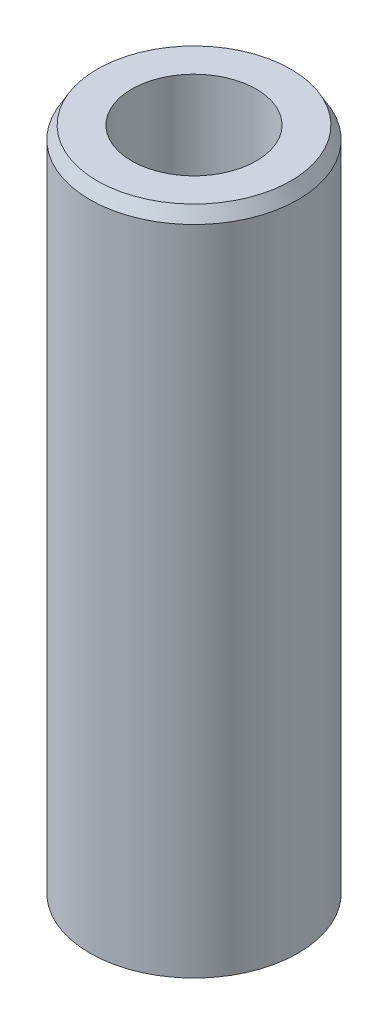
ISO-10303-21;
HEADER;
FILE_DESCRIPTION(('STEP AP214'),'2;1');
FILE_NAME('part.step','',(''),(''),'','','');
FILE_SCHEMA(('AUTOMOTIVE_DESIGN { 1 0 10303 214 1 1 1 1 }'));
ENDSEC;
DATA;
#1=APPLICATION_CONTEXT('core data for automotive mechanical design processes');
#2=APPLICATION_PROTOCOL_DEFINITION('international standard','automotive_design',2000,#1);
#3=PRODUCT_CONTEXT('',#1,'mechanical');
#4=PRODUCT('Part','Part','',(#3));
#5=PRODUCT_RELATED_PRODUCT_CATEGORY('part','',(#4));
#6=PRODUCT_DEFINITION_FORMATION('','',#4);
#7=PRODUCT_DEFINITION_CONTEXT('part definition',#1,'design');
#8=PRODUCT_DEFINITION('design','',#6,#7);
#9=PRODUCT_DEFINITION_SHAPE('','',#8);
#10=(LENGTH_UNIT() NAMED_UNIT(*) SI_UNIT(.MILLI.,.METRE.));
#11=(NAMED_UNIT(*) PLANE_ANGLE_UNIT() SI_UNIT($,.RADIAN.));
#12=(NAMED_UNIT(*) SI_UNIT($,.STERADIAN.) SOLID_ANGLE_UNIT());
#13=UNCERTAINTY_MEASURE_WITH_UNIT(LENGTH_MEASURE(1.E-05),#10,'distance_accuracy_value','');
#14=(GEOMETRIC_REPRESENTATION_CONTEXT(3) GLOBAL_UNCERTAINTY_ASSIGNED_CONTEXT((#13)) GLOBAL_UNIT_ASSIGNED_CONTEXT((#10,
#11,#12)) REPRESENTATION_CONTEXT('',''));
#15=CARTESIAN_POINT('',(0.,0.,0.));
#16=DIRECTION('',(0.,0.,1.));
#17=DIRECTION('',(1.,0.,0.));
#18=AXIS2_PLACEMENT_3D('',#15,#16,#17);
#19=CARTESIAN_POINT('',(0.,64.6007323548233,0.));
#20=DIRECTION('',(0.,-1.,0.));
#21=DIRECTION('',(0.,0.,-1.));
#22=AXIS2_PLACEMENT_3D('',#19,#20,#21);
#23=CYLINDRICAL_SURFACE('',#22,10.);
#24=CARTESIAN_POINT('',(0.,63.3904368372512,0.));
#25=DIRECTION('',(0.,1.,0.));
#26=DIRECTION('',(0.,0.,1.));
#27=AXIS2_PLACEMENT_3D('',#24,#25,#26);
#28=CIRCLE('',#27,10.);
#29=CARTESIAN_POINT('',(0.,63.3904368372512,10.));
#30=VERTEX_POINT('',#29);
#31=EDGE_CURVE('E50',#30,#30,#28,.F.);
#32=ORIENTED_EDGE('',*,*,#31,.T.);
#33=EDGE_LOOP('',(#32));
#34=FACE_BOUND('',#33,.T.);
#35=CARTESIAN_POINT('',(0.,0.698764442869246,0.));
#36=DIRECTION('',(0.,1.,0.));
#37=DIRECTION('',(0.,0.,1.));
#38=AXIS2_PLACEMENT_3D('',#35,#36,#37);
#39=CIRCLE('',#38,10.);
#40=CARTESIAN_POINT('',(0.,0.698764442869246,10.));
#41=VERTEX_POINT('',#40);
#42=EDGE_CURVE('E51',#41,#41,#39,.T.);
#43=ORIENTED_EDGE('',*,*,#42,.T.);
#44=EDGE_LOOP('',(#43));
#45=FACE_BOUND('',#44,.T.);
#46=ADVANCED_FACE('F39',(#34,#45),#23,.T.);
#47=CARTESIAN_POINT('',(0.,64.6007323548233,0.));
#48=DIRECTION('',(0.,1.,0.));
#49=DIRECTION('',(0.,0.,1.));
#50=AXIS2_PLACEMENT_3D('',#47,#48,#49);
#51=PLANE('',#50);
#52=CARTESIAN_POINT('',(0.,64.6007323548233,0.));
#53=DIRECTION('',(0.,1.,0.));
#54=DIRECTION('',(0.,0.,1.));
#55=AXIS2_PLACEMENT_3D('',#52,#53,#54);
#56=CIRCLE('',#55,9.30123555713077);
#57=CARTESIAN_POINT('',(0.,64.6007323548233,9.30123555713077));
#58=VERTEX_POINT('',#57);
#59=EDGE_CURVE('E54',#58,#58,#56,.T.);
#60=ORIENTED_EDGE('',*,*,#59,.T.);
#61=EDGE_LOOP('',(#60));
#62=FACE_BOUND('',#61,.T.);
#63=CARTESIAN_POINT('',(0.,64.6007323548233,0.));
#64=DIRECTION('',(0.,1.,0.));
#65=DIRECTION('',(0.,0.,1.));
#66=AXIS2_PLACEMENT_3D('',#63,#64,#65);
#67=CIRCLE('',#66,5.98507596323646);
#68=CARTESIAN_POINT('',(0.,64.6007323548233,5.98507596323646));
#69=VERTEX_POINT('',#68);
#70=EDGE_CURVE('E58',#69,#69,#67,.T.);
#71=ORIENTED_EDGE('',*,*,#70,.F.);
#72=EDGE_LOOP('',(#71));
#73=FACE_BOUND('',#72,.T.);
#74=ADVANCED_FACE('F69',(#62,#73),#51,.T.);
#75=CARTESIAN_POINT('',(0.,0.,0.));
#76=DIRECTION('',(0.,1.,0.));
#77=DIRECTION('',(0.,0.,1.));
#78=AXIS2_PLACEMENT_3D('',#75,#76,#77);
#79=PLANE('',#78);
#80=CARTESIAN_POINT('',(0.,0.,0.));
#81=DIRECTION('',(0.,1.,0.));
#82=DIRECTION('',(0.,0.,1.));
#83=AXIS2_PLACEMENT_3D('',#80,#81,#82);
#84=CIRCLE('',#83,8.78970448242789);
#85=CARTESIAN_POINT('',(0.,0.,8.78970448242789));
#86=VERTEX_POINT('',#85);
#87=EDGE_CURVE('E10',#86,#86,#84,.F.);
#88=ORIENTED_EDGE('',*,*,#87,.T.);
#89=EDGE_LOOP('',(#88));
#90=FACE_BOUND('',#89,.T.);
#91=CARTESIAN_POINT('',(0.,0.,0.));
#92=DIRECTION('',(0.,1.,0.));
#93=DIRECTION('',(0.,0.,1.));
#94=AXIS2_PLACEMENT_3D('',#91,#92,#93);
#95=CIRCLE('',#94,5.98507596323646);
#96=CARTESIAN_POINT('',(0.,0.,5.98507596323646));
#97=VERTEX_POINT('',#96);
#98=EDGE_CURVE('E63',#97,#97,#95,.T.);
#99=ORIENTED_EDGE('',*,*,#98,.T.);
#100=EDGE_LOOP('',(#99));
#101=FACE_BOUND('',#100,.T.);
#102=ADVANCED_FACE('F75',(#90,#101),#79,.F.);
#103=CARTESIAN_POINT('',(0.,64.6007323548233,0.));
#104=DIRECTION('',(0.,-1.,0.));
#105=DIRECTION('',(0.,0.,-1.));
#106=AXIS2_PLACEMENT_3D('',#103,#104,#105);
#107=CYLINDRICAL_SURFACE('',#106,5.98507596323646);
#108=ORIENTED_EDGE('',*,*,#70,.T.);
#109=EDGE_LOOP('',(#108));
#110=FACE_BOUND('',#109,.T.);
#111=ORIENTED_EDGE('',*,*,#98,.F.);
#112=EDGE_LOOP('',(#111));
#113=FACE_BOUND('',#112,.T.);
#114=ADVANCED_FACE('F70',(#110,#113),#107,.F.);
#115=CARTESIAN_POINT('',(0.,64.6007323548233,0.));
#116=DIRECTION('',(0.,-1.,0.));
#117=DIRECTION('',(0.,0.,-1.));
#118=AXIS2_PLACEMENT_3D('',#115,#116,#117);
#119=CONICAL_SURFACE('',#118,9.30123555713077,0.523598775598298);
#120=ORIENTED_EDGE('',*,*,#31,.F.);
#121=EDGE_LOOP('',(#120));
#122=FACE_BOUND('',#121,.T.);
#123=ORIENTED_EDGE('',*,*,#59,.F.);
#124=EDGE_LOOP('',(#123));
#125=FACE_BOUND('',#124,.T.);
#126=ADVANCED_FACE('F81',(#122,#125),#119,.T.);
#127=CARTESIAN_POINT('',(0.,0.698764442869246,0.));
#128=DIRECTION('',(0.,1.,0.));
#129=DIRECTION('',(0.,0.,1.));
#130=AXIS2_PLACEMENT_3D('',#127,#128,#129);
#131=CONICAL_SURFACE('',#130,10.,1.0471975511966);
#132=ORIENTED_EDGE('',*,*,#87,.F.);
#133=EDGE_LOOP('',(#132));
#134=FACE_BOUND('',#133,.T.);
#135=ORIENTED_EDGE('',*,*,#42,.F.);
#136=EDGE_LOOP('',(#135));
#137=FACE_BOUND('',#136,.T.);
#138=ADVANCED_FACE('F45',(#134,#137),#131,.T.);
#139=CLOSED_SHELL('',(#46,#74,#102,#114,#126,#138));
#140=MANIFOLD_SOLID_BREP('B2',#139);
#141=ADVANCED_BREP_SHAPE_REPRESENTATION('',(#18,#140),#14);
#142=SHAPE_DEFINITION_REPRESENTATION(#9,#141);
ENDSEC;
END-ISO-10303-21;
